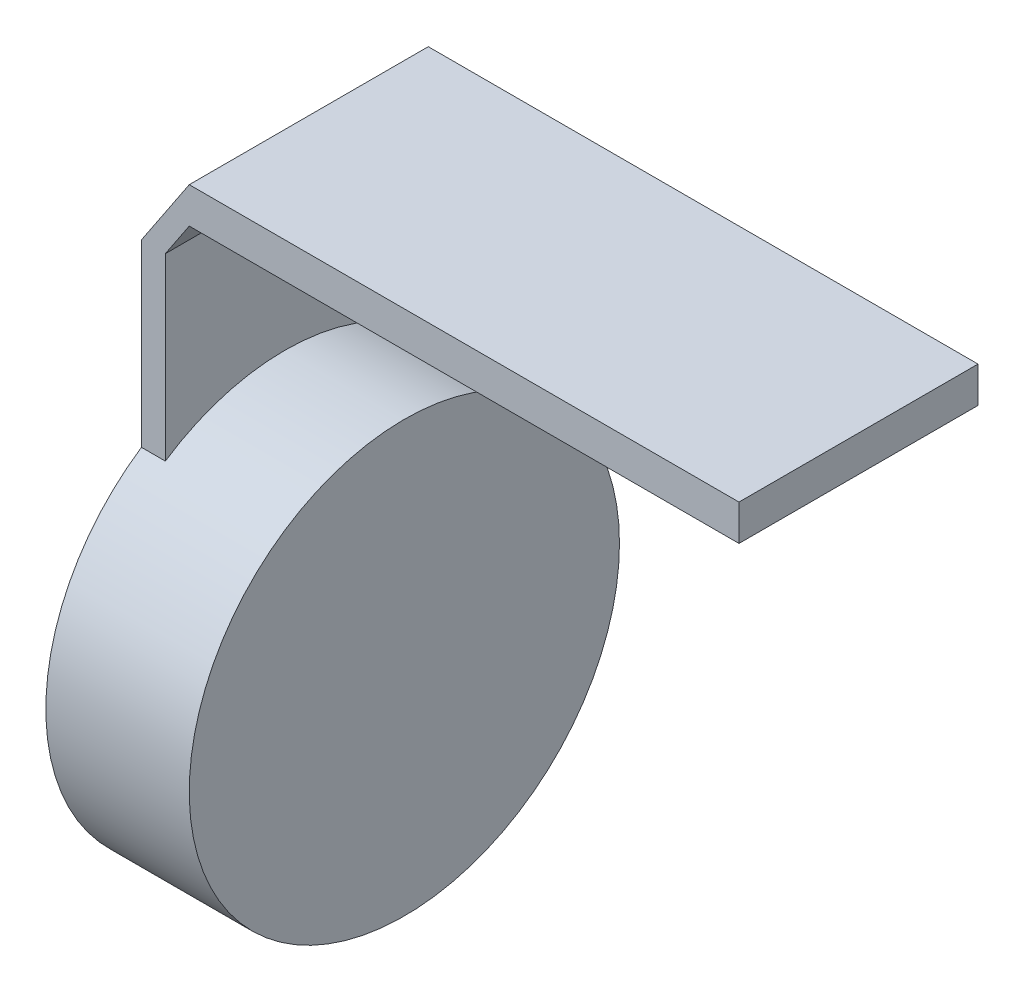
ISO-10303-21;
HEADER;
FILE_DESCRIPTION(('STEP AP214'),'2;1');
FILE_NAME('part.step','',(''),(''),'','','');
FILE_SCHEMA(('AUTOMOTIVE_DESIGN { 1 0 10303 214 1 1 1 1 }'));
ENDSEC;
DATA;
#1=APPLICATION_CONTEXT('core data for automotive mechanical design processes');
#2=APPLICATION_PROTOCOL_DEFINITION('international standard','automotive_design',2000,#1);
#3=PRODUCT_CONTEXT('',#1,'mechanical');
#4=PRODUCT('Part','Part','',(#3));
#5=PRODUCT_RELATED_PRODUCT_CATEGORY('part','',(#4));
#6=PRODUCT_DEFINITION_FORMATION('','',#4);
#7=PRODUCT_DEFINITION_CONTEXT('part definition',#1,'design');
#8=PRODUCT_DEFINITION('design','',#6,#7);
#9=PRODUCT_DEFINITION_SHAPE('','',#8);
#10=(LENGTH_UNIT() NAMED_UNIT(*) SI_UNIT(.MILLI.,.METRE.));
#11=(NAMED_UNIT(*) PLANE_ANGLE_UNIT() SI_UNIT($,.RADIAN.));
#12=(NAMED_UNIT(*) SI_UNIT($,.STERADIAN.) SOLID_ANGLE_UNIT());
#13=UNCERTAINTY_MEASURE_WITH_UNIT(LENGTH_MEASURE(1.E-05),#10,'distance_accuracy_value','');
#14=(GEOMETRIC_REPRESENTATION_CONTEXT(3) GLOBAL_UNCERTAINTY_ASSIGNED_CONTEXT((#13)) GLOBAL_UNIT_ASSIGNED_CONTEXT((#10,
#11,#12)) REPRESENTATION_CONTEXT('',''));
#15=CARTESIAN_POINT('',(0.,0.,0.));
#16=DIRECTION('',(0.,0.,1.));
#17=DIRECTION('',(1.,0.,0.));
#18=AXIS2_PLACEMENT_3D('',#15,#16,#17);
#19=CARTESIAN_POINT('',(10.,0.,0.));
#20=DIRECTION('',(-1.,0.,0.));
#21=DIRECTION('',(0.,0.,1.));
#22=AXIS2_PLACEMENT_3D('',#19,#20,#21);
#23=CYLINDRICAL_SURFACE('',#22,18.);
#24=CARTESIAN_POINT('',(10.,0.,0.));
#25=DIRECTION('',(1.,0.,0.));
#26=DIRECTION('',(0.,0.,-1.));
#27=AXIS2_PLACEMENT_3D('',#24,#25,#26);
#28=CIRCLE('',#27,18.);
#29=CARTESIAN_POINT('',(10.,0.,-18.));
#30=VERTEX_POINT('',#29);
#31=EDGE_CURVE('E11',#30,#30,#28,.T.);
#32=ORIENTED_EDGE('',*,*,#31,.F.);
#33=EDGE_LOOP('',(#32));
#34=FACE_BOUND('',#33,.T.);
#35=CARTESIAN_POINT('',(0.,0.,0.));
#36=DIRECTION('',(1.,0.,0.));
#37=DIRECTION('',(0.,0.,-1.));
#38=AXIS2_PLACEMENT_3D('',#35,#36,#37);
#39=CIRCLE('',#38,18.);
#40=CARTESIAN_POINT('',(0.,14.9666295470958,-10.));
#41=VERTEX_POINT('',#40);
#42=CARTESIAN_POINT('',(0.,14.9666295470958,10.));
#43=VERTEX_POINT('',#42);
#44=EDGE_CURVE('E42',#41,#43,#39,.T.);
#45=ORIENTED_EDGE('',*,*,#44,.T.);
#46=DIRECTION('',(1.,0.,0.));
#47=VECTOR('',#46,1.);
#48=CARTESIAN_POINT('',(-2.,14.9666295470958,10.));
#49=LINE('',#48,#47);
#50=CARTESIAN_POINT('',(-2.,14.9666295470958,10.));
#51=VERTEX_POINT('',#50);
#52=EDGE_CURVE('E76',#51,#43,#49,.T.);
#53=ORIENTED_EDGE('',*,*,#52,.F.);
#54=CARTESIAN_POINT('',(-2.,0.,0.));
#55=DIRECTION('',(-1.,0.,0.));
#56=DIRECTION('',(0.,0.,1.));
#57=AXIS2_PLACEMENT_3D('',#54,#55,#56);
#58=CIRCLE('',#57,18.);
#59=CARTESIAN_POINT('',(-2.,14.9666295470958,-10.));
#60=VERTEX_POINT('',#59);
#61=EDGE_CURVE('E61',#60,#51,#58,.T.);
#62=ORIENTED_EDGE('',*,*,#61,.F.);
#63=DIRECTION('',(1.,0.,0.));
#64=VECTOR('',#63,1.);
#65=CARTESIAN_POINT('',(-2.,14.9666295470958,-10.));
#66=LINE('',#65,#64);
#67=EDGE_CURVE('E53',#60,#41,#66,.T.);
#68=ORIENTED_EDGE('',*,*,#67,.T.);
#69=EDGE_LOOP('',(#45,#53,#62,#68));
#70=FACE_BOUND('',#69,.T.);
#71=ADVANCED_FACE('F39',(#34,#70),#23,.T.);
#72=CARTESIAN_POINT('',(10.,0.,0.));
#73=DIRECTION('',(1.,0.,0.));
#74=DIRECTION('',(0.,0.,-1.));
#75=AXIS2_PLACEMENT_3D('',#72,#73,#74);
#76=PLANE('',#75);
#77=ORIENTED_EDGE('',*,*,#31,.T.);
#78=EDGE_LOOP('',(#77));
#79=FACE_BOUND('',#78,.T.);
#80=ADVANCED_FACE('F199',(#79),#76,.T.);
#81=CARTESIAN_POINT('',(-2.,14.9666295470958,10.));
#82=DIRECTION('',(0.,0.,-1.));
#83=DIRECTION('',(-1.,0.,0.));
#84=AXIS2_PLACEMENT_3D('',#81,#82,#83);
#85=PLANE('',#84);
#86=DIRECTION('',(0.,1.,0.));
#87=VECTOR('',#86,1.);
#88=CARTESIAN_POINT('',(0.,14.9666295470958,10.));
#89=LINE('',#88,#87);
#90=CARTESIAN_POINT('',(0.,30.,10.));
#91=VERTEX_POINT('',#90);
#92=EDGE_CURVE('E156',#43,#91,#89,.T.);
#93=ORIENTED_EDGE('',*,*,#92,.T.);
#94=DIRECTION('',(-0.554700196225229,-0.832050294337844,0.));
#95=VECTOR('',#94,1.);
#96=CARTESIAN_POINT('',(2.,33.,9.99999999999999));
#97=LINE('',#96,#95);
#98=CARTESIAN_POINT('',(2.,33.,9.99999999999999));
#99=VERTEX_POINT('',#98);
#100=EDGE_CURVE('E122',#99,#91,#97,.T.);
#101=ORIENTED_EDGE('',*,*,#100,.F.);
#102=DIRECTION('',(-1.,0.,0.));
#103=VECTOR('',#102,1.);
#104=CARTESIAN_POINT('',(2.,33.,9.99999999999999));
#105=LINE('',#104,#103);
#106=CARTESIAN_POINT('',(48.,33.,9.99999999999999));
#107=VERTEX_POINT('',#106);
#108=EDGE_CURVE('E141',#107,#99,#105,.T.);
#109=ORIENTED_EDGE('',*,*,#108,.F.);
#110=DIRECTION('',(0.,-1.,0.));
#111=VECTOR('',#110,1.);
#112=CARTESIAN_POINT('',(48.,33.,9.99999999999999));
#113=LINE('',#112,#111);
#114=CARTESIAN_POINT('',(48.,36.,9.99999999999999));
#115=VERTEX_POINT('',#114);
#116=EDGE_CURVE('E130',#115,#107,#113,.T.);
#117=ORIENTED_EDGE('',*,*,#116,.F.);
#118=DIRECTION('',(1.,0.,0.));
#119=VECTOR('',#118,1.);
#120=CARTESIAN_POINT('',(2.00000000000001,36.,9.99999999999999));
#121=LINE('',#120,#119);
#122=CARTESIAN_POINT('',(2.00000000000001,36.,9.99999999999999));
#123=VERTEX_POINT('',#122);
#124=EDGE_CURVE('E114',#123,#115,#121,.T.);
#125=ORIENTED_EDGE('',*,*,#124,.F.);
#126=DIRECTION('',(0.55470019622523,0.832050294337843,0.));
#127=VECTOR('',#126,1.);
#128=CARTESIAN_POINT('',(-2.,30.,9.99999999999999));
#129=LINE('',#128,#127);
#130=CARTESIAN_POINT('',(-2.,30.,10.));
#131=VERTEX_POINT('',#130);
#132=EDGE_CURVE('E127',#131,#123,#129,.T.);
#133=ORIENTED_EDGE('',*,*,#132,.F.);
#134=DIRECTION('',(0.,1.,0.));
#135=VECTOR('',#134,1.);
#136=CARTESIAN_POINT('',(-2.,14.9666295470958,10.));
#137=LINE('',#136,#135);
#138=EDGE_CURVE('E80',#51,#131,#137,.T.);
#139=ORIENTED_EDGE('',*,*,#138,.F.);
#140=ORIENTED_EDGE('',*,*,#52,.T.);
#141=EDGE_LOOP('',(#93,#101,#109,#117,#125,#133,#139,#140));
#142=FACE_BOUND('',#141,.T.);
#143=ADVANCED_FACE('F126',(#142),#85,.F.);
#144=CARTESIAN_POINT('',(-2.,14.9666295470958,-10.));
#145=DIRECTION('',(0.,0.,1.));
#146=DIRECTION('',(1.,0.,0.));
#147=AXIS2_PLACEMENT_3D('',#144,#145,#146);
#148=PLANE('',#147);
#149=DIRECTION('',(0.,-1.,0.));
#150=VECTOR('',#149,1.);
#151=CARTESIAN_POINT('',(0.,14.9666295470958,-10.));
#152=LINE('',#151,#150);
#153=CARTESIAN_POINT('',(0.,30.,-10.));
#154=VERTEX_POINT('',#153);
#155=EDGE_CURVE('E161',#154,#41,#152,.T.);
#156=ORIENTED_EDGE('',*,*,#155,.T.);
#157=ORIENTED_EDGE('',*,*,#67,.F.);
#158=DIRECTION('',(0.,-1.,0.));
#159=VECTOR('',#158,1.);
#160=CARTESIAN_POINT('',(-2.,14.9666295470958,-10.));
#161=LINE('',#160,#159);
#162=CARTESIAN_POINT('',(-2.,30.,-10.));
#163=VERTEX_POINT('',#162);
#164=EDGE_CURVE('E163',#163,#60,#161,.T.);
#165=ORIENTED_EDGE('',*,*,#164,.F.);
#166=DIRECTION('',(0.55470019622523,0.832050294337843,0.));
#167=VECTOR('',#166,1.);
#168=CARTESIAN_POINT('',(-2.,30.,-10.));
#169=LINE('',#168,#167);
#170=CARTESIAN_POINT('',(2.00000000000001,36.,-10.));
#171=VERTEX_POINT('',#170);
#172=EDGE_CURVE('E146',#163,#171,#169,.T.);
#173=ORIENTED_EDGE('',*,*,#172,.T.);
#174=DIRECTION('',(1.,0.,0.));
#175=VECTOR('',#174,1.);
#176=CARTESIAN_POINT('',(2.00000000000001,36.,-10.));
#177=LINE('',#176,#175);
#178=CARTESIAN_POINT('',(48.,36.,-10.));
#179=VERTEX_POINT('',#178);
#180=EDGE_CURVE('E116',#171,#179,#177,.T.);
#181=ORIENTED_EDGE('',*,*,#180,.T.);
#182=DIRECTION('',(0.,-1.,0.));
#183=VECTOR('',#182,1.);
#184=CARTESIAN_POINT('',(48.,33.,-10.));
#185=LINE('',#184,#183);
#186=CARTESIAN_POINT('',(48.,33.,-10.));
#187=VERTEX_POINT('',#186);
#188=EDGE_CURVE('E149',#179,#187,#185,.T.);
#189=ORIENTED_EDGE('',*,*,#188,.T.);
#190=DIRECTION('',(-1.,0.,0.));
#191=VECTOR('',#190,1.);
#192=CARTESIAN_POINT('',(2.,33.,-10.));
#193=LINE('',#192,#191);
#194=CARTESIAN_POINT('',(2.,33.,-10.));
#195=VERTEX_POINT('',#194);
#196=EDGE_CURVE('E137',#187,#195,#193,.T.);
#197=ORIENTED_EDGE('',*,*,#196,.T.);
#198=DIRECTION('',(-0.554700196225229,-0.832050294337844,0.));
#199=VECTOR('',#198,1.);
#200=CARTESIAN_POINT('',(2.,33.,-10.));
#201=LINE('',#200,#199);
#202=EDGE_CURVE('E134',#195,#154,#201,.T.);
#203=ORIENTED_EDGE('',*,*,#202,.T.);
#204=EDGE_LOOP('',(#156,#157,#165,#173,#181,#189,#197,#203));
#205=FACE_BOUND('',#204,.T.);
#206=ADVANCED_FACE('F186',(#205),#148,.F.);
#207=CARTESIAN_POINT('',(-2.,0.,0.));
#208=DIRECTION('',(-1.,0.,0.));
#209=DIRECTION('',(0.,0.,1.));
#210=AXIS2_PLACEMENT_3D('',#207,#208,#209);
#211=PLANE('',#210);
#212=ORIENTED_EDGE('',*,*,#61,.T.);
#213=ORIENTED_EDGE('',*,*,#138,.T.);
#214=DIRECTION('',(0.,0.,-1.));
#215=VECTOR('',#214,1.);
#216=CARTESIAN_POINT('',(-2.,30.,-10.));
#217=LINE('',#216,#215);
#218=EDGE_CURVE('E133',#131,#163,#217,.T.);
#219=ORIENTED_EDGE('',*,*,#218,.T.);
#220=ORIENTED_EDGE('',*,*,#164,.T.);
#221=EDGE_LOOP('',(#212,#213,#219,#220));
#222=FACE_BOUND('',#221,.T.);
#223=ADVANCED_FACE('F188',(#222),#211,.T.);
#224=CARTESIAN_POINT('',(0.,0.,0.));
#225=DIRECTION('',(-1.,0.,0.));
#226=DIRECTION('',(0.,0.,1.));
#227=AXIS2_PLACEMENT_3D('',#224,#225,#226);
#228=PLANE('',#227);
#229=ORIENTED_EDGE('',*,*,#44,.F.);
#230=ORIENTED_EDGE('',*,*,#155,.F.);
#231=DIRECTION('',(0.,0.,-1.));
#232=VECTOR('',#231,1.);
#233=CARTESIAN_POINT('',(0.,30.,-10.));
#234=LINE('',#233,#232);
#235=EDGE_CURVE('E167',#91,#154,#234,.T.);
#236=ORIENTED_EDGE('',*,*,#235,.F.);
#237=ORIENTED_EDGE('',*,*,#92,.F.);
#238=EDGE_LOOP('',(#229,#230,#236,#237));
#239=FACE_BOUND('',#238,.T.);
#240=ADVANCED_FACE('F174',(#239),#228,.F.);
#241=CARTESIAN_POINT('',(2.,33.,9.99999999999999));
#242=DIRECTION('',(0.832050294337844,-0.554700196225229,0.));
#243=DIRECTION('',(0.554700196225229,0.832050294337844,0.));
#244=AXIS2_PLACEMENT_3D('',#241,#242,#243);
#245=PLANE('',#244);
#246=ORIENTED_EDGE('',*,*,#202,.F.);
#247=DIRECTION('',(0.,0.,-1.));
#248=VECTOR('',#247,1.);
#249=CARTESIAN_POINT('',(2.,33.,9.99999999999999));
#250=LINE('',#249,#248);
#251=EDGE_CURVE('E154',#99,#195,#250,.T.);
#252=ORIENTED_EDGE('',*,*,#251,.F.);
#253=ORIENTED_EDGE('',*,*,#100,.T.);
#254=ORIENTED_EDGE('',*,*,#235,.T.);
#255=EDGE_LOOP('',(#246,#252,#253,#254));
#256=FACE_BOUND('',#255,.T.);
#257=ADVANCED_FACE('F178',(#256),#245,.T.);
#258=CARTESIAN_POINT('',(2.,33.,9.99999999999999));
#259=DIRECTION('',(0.,-1.,0.));
#260=DIRECTION('',(0.,0.,-1.));
#261=AXIS2_PLACEMENT_3D('',#258,#259,#260);
#262=PLANE('',#261);
#263=ORIENTED_EDGE('',*,*,#196,.F.);
#264=DIRECTION('',(0.,0.,-1.));
#265=VECTOR('',#264,1.);
#266=CARTESIAN_POINT('',(48.,33.,9.99999999999999));
#267=LINE('',#266,#265);
#268=EDGE_CURVE('E157',#107,#187,#267,.T.);
#269=ORIENTED_EDGE('',*,*,#268,.F.);
#270=ORIENTED_EDGE('',*,*,#108,.T.);
#271=ORIENTED_EDGE('',*,*,#251,.T.);
#272=EDGE_LOOP('',(#263,#269,#270,#271));
#273=FACE_BOUND('',#272,.T.);
#274=ADVANCED_FACE('F181',(#273),#262,.T.);
#275=CARTESIAN_POINT('',(48.,33.,9.99999999999999));
#276=DIRECTION('',(1.,0.,0.));
#277=DIRECTION('',(0.,0.,-1.));
#278=AXIS2_PLACEMENT_3D('',#275,#276,#277);
#279=PLANE('',#278);
#280=ORIENTED_EDGE('',*,*,#188,.F.);
#281=DIRECTION('',(0.,0.,-1.));
#282=VECTOR('',#281,1.);
#283=CARTESIAN_POINT('',(48.,36.,9.99999999999999));
#284=LINE('',#283,#282);
#285=EDGE_CURVE('E121',#115,#179,#284,.T.);
#286=ORIENTED_EDGE('',*,*,#285,.F.);
#287=ORIENTED_EDGE('',*,*,#116,.T.);
#288=ORIENTED_EDGE('',*,*,#268,.T.);
#289=EDGE_LOOP('',(#280,#286,#287,#288));
#290=FACE_BOUND('',#289,.T.);
#291=ADVANCED_FACE('F184',(#290),#279,.T.);
#292=CARTESIAN_POINT('',(2.00000000000001,36.,9.99999999999999));
#293=DIRECTION('',(0.,1.,0.));
#294=DIRECTION('',(-1.,0.,0.));
#295=AXIS2_PLACEMENT_3D('',#292,#293,#294);
#296=PLANE('',#295);
#297=ORIENTED_EDGE('',*,*,#180,.F.);
#298=DIRECTION('',(0.,0.,-1.));
#299=VECTOR('',#298,1.);
#300=CARTESIAN_POINT('',(2.00000000000001,36.,9.99999999999999));
#301=LINE('',#300,#299);
#302=EDGE_CURVE('E111',#123,#171,#301,.T.);
#303=ORIENTED_EDGE('',*,*,#302,.F.);
#304=ORIENTED_EDGE('',*,*,#124,.T.);
#305=ORIENTED_EDGE('',*,*,#285,.T.);
#306=EDGE_LOOP('',(#297,#303,#304,#305));
#307=FACE_BOUND('',#306,.T.);
#308=ADVANCED_FACE('F113',(#307),#296,.T.);
#309=CARTESIAN_POINT('',(-2.,30.,9.99999999999999));
#310=DIRECTION('',(-0.832050294337843,0.55470019622523,0.));
#311=DIRECTION('',(-0.55470019622523,-0.832050294337843,0.));
#312=AXIS2_PLACEMENT_3D('',#309,#310,#311);
#313=PLANE('',#312);
#314=ORIENTED_EDGE('',*,*,#172,.F.);
#315=ORIENTED_EDGE('',*,*,#218,.F.);
#316=ORIENTED_EDGE('',*,*,#132,.T.);
#317=ORIENTED_EDGE('',*,*,#302,.T.);
#318=EDGE_LOOP('',(#314,#315,#316,#317));
#319=FACE_BOUND('',#318,.T.);
#320=ADVANCED_FACE('F132',(#319),#313,.T.);
#321=CLOSED_SHELL('',(#71,#80,#143,#206,#223,#240,#257,#274,#291,#308,#320));
#322=MANIFOLD_SOLID_BREP('B2',#321);
#323=ADVANCED_BREP_SHAPE_REPRESENTATION('',(#18,#322),#14);
#324=SHAPE_DEFINITION_REPRESENTATION(#9,#323);
ENDSEC;
END-ISO-10303-21;
